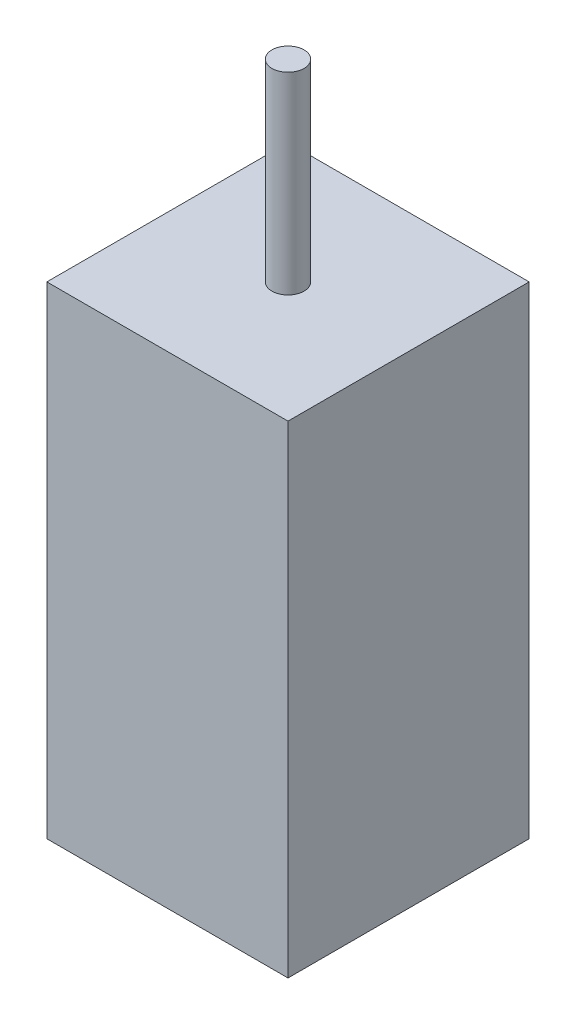
ISO-10303-21;
HEADER;
FILE_DESCRIPTION(('STEP AP214'),'2;1');
FILE_NAME('part.step','',(''),(''),'','','');
FILE_SCHEMA(('AUTOMOTIVE_DESIGN { 1 0 10303 214 1 1 1 1 }'));
ENDSEC;
DATA;
#1=APPLICATION_CONTEXT('core data for automotive mechanical design processes');
#2=APPLICATION_PROTOCOL_DEFINITION('international standard','automotive_design',2000,#1);
#3=PRODUCT_CONTEXT('',#1,'mechanical');
#4=PRODUCT('Part','Part','',(#3));
#5=PRODUCT_RELATED_PRODUCT_CATEGORY('part','',(#4));
#6=PRODUCT_DEFINITION_FORMATION('','',#4);
#7=PRODUCT_DEFINITION_CONTEXT('part definition',#1,'design');
#8=PRODUCT_DEFINITION('design','',#6,#7);
#9=PRODUCT_DEFINITION_SHAPE('','',#8);
#10=(LENGTH_UNIT() NAMED_UNIT(*) SI_UNIT(.MILLI.,.METRE.));
#11=(NAMED_UNIT(*) PLANE_ANGLE_UNIT() SI_UNIT($,.RADIAN.));
#12=(NAMED_UNIT(*) SI_UNIT($,.STERADIAN.) SOLID_ANGLE_UNIT());
#13=UNCERTAINTY_MEASURE_WITH_UNIT(LENGTH_MEASURE(1.E-05),#10,'distance_accuracy_value','');
#14=(GEOMETRIC_REPRESENTATION_CONTEXT(3) GLOBAL_UNCERTAINTY_ASSIGNED_CONTEXT((#13)) GLOBAL_UNIT_ASSIGNED_CONTEXT((#10,
#11,#12)) REPRESENTATION_CONTEXT('',''));
#15=CARTESIAN_POINT('',(0.,0.,0.));
#16=DIRECTION('',(0.,0.,1.));
#17=DIRECTION('',(1.,0.,0.));
#18=AXIS2_PLACEMENT_3D('',#15,#16,#17);
#19=CARTESIAN_POINT('',(7.5,30.,-7.5));
#20=DIRECTION('',(-1.,0.,0.));
#21=DIRECTION('',(0.,0.,1.));
#22=AXIS2_PLACEMENT_3D('',#19,#20,#21);
#23=PLANE('',#22);
#24=DIRECTION('',(0.,0.,-1.));
#25=VECTOR('',#24,1.);
#26=CARTESIAN_POINT('',(7.5,0.,-7.5));
#27=LINE('',#26,#25);
#28=CARTESIAN_POINT('',(7.5,0.,7.5));
#29=VERTEX_POINT('',#28);
#30=CARTESIAN_POINT('',(7.5,0.,-7.5));
#31=VERTEX_POINT('',#30);
#32=EDGE_CURVE('E96',#29,#31,#27,.T.);
#33=ORIENTED_EDGE('',*,*,#32,.T.);
#34=DIRECTION('',(0.,-1.,0.));
#35=VECTOR('',#34,1.);
#36=CARTESIAN_POINT('',(7.5,30.,-7.5));
#37=LINE('',#36,#35);
#38=CARTESIAN_POINT('',(7.5,30.,-7.5));
#39=VERTEX_POINT('',#38);
#40=EDGE_CURVE('E11',#39,#31,#37,.T.);
#41=ORIENTED_EDGE('',*,*,#40,.F.);
#42=DIRECTION('',(0.,0.,-1.));
#43=VECTOR('',#42,1.);
#44=CARTESIAN_POINT('',(7.5,30.,-7.5));
#45=LINE('',#44,#43);
#46=CARTESIAN_POINT('',(7.5,30.,7.5));
#47=VERTEX_POINT('',#46);
#48=EDGE_CURVE('E84',#47,#39,#45,.T.);
#49=ORIENTED_EDGE('',*,*,#48,.F.);
#50=DIRECTION('',(0.,-1.,0.));
#51=VECTOR('',#50,1.);
#52=CARTESIAN_POINT('',(7.5,30.,7.5));
#53=LINE('',#52,#51);
#54=EDGE_CURVE('E92',#47,#29,#53,.T.);
#55=ORIENTED_EDGE('',*,*,#54,.T.);
#56=EDGE_LOOP('',(#33,#41,#49,#55));
#57=FACE_BOUND('',#56,.T.);
#58=ADVANCED_FACE('F33',(#57),#23,.F.);
#59=CARTESIAN_POINT('',(-7.5,30.,-7.5));
#60=DIRECTION('',(0.,0.,1.));
#61=DIRECTION('',(1.,0.,0.));
#62=AXIS2_PLACEMENT_3D('',#59,#60,#61);
#63=PLANE('',#62);
#64=DIRECTION('',(-1.,0.,0.));
#65=VECTOR('',#64,1.);
#66=CARTESIAN_POINT('',(-7.5,0.,-7.5));
#67=LINE('',#66,#65);
#68=CARTESIAN_POINT('',(-7.5,0.,-7.5));
#69=VERTEX_POINT('',#68);
#70=EDGE_CURVE('E88',#31,#69,#67,.T.);
#71=ORIENTED_EDGE('',*,*,#70,.T.);
#72=DIRECTION('',(0.,-1.,0.));
#73=VECTOR('',#72,1.);
#74=CARTESIAN_POINT('',(-7.5,30.,-7.5));
#75=LINE('',#74,#73);
#76=CARTESIAN_POINT('',(-7.5,30.,-7.5));
#77=VERTEX_POINT('',#76);
#78=EDGE_CURVE('E41',#77,#69,#75,.T.);
#79=ORIENTED_EDGE('',*,*,#78,.F.);
#80=DIRECTION('',(-1.,0.,0.));
#81=VECTOR('',#80,1.);
#82=CARTESIAN_POINT('',(-7.5,30.,-7.5));
#83=LINE('',#82,#81);
#84=EDGE_CURVE('E79',#39,#77,#83,.T.);
#85=ORIENTED_EDGE('',*,*,#84,.F.);
#86=ORIENTED_EDGE('',*,*,#40,.T.);
#87=EDGE_LOOP('',(#71,#79,#85,#86));
#88=FACE_BOUND('',#87,.T.);
#89=ADVANCED_FACE('F87',(#88),#63,.F.);
#90=CARTESIAN_POINT('',(-7.5,30.,-7.5));
#91=DIRECTION('',(1.,0.,0.));
#92=DIRECTION('',(0.,0.,-1.));
#93=AXIS2_PLACEMENT_3D('',#90,#91,#92);
#94=PLANE('',#93);
#95=DIRECTION('',(0.,0.,1.));
#96=VECTOR('',#95,1.);
#97=CARTESIAN_POINT('',(-7.5,0.,-7.5));
#98=LINE('',#97,#96);
#99=CARTESIAN_POINT('',(-7.5,0.,7.5));
#100=VERTEX_POINT('',#99);
#101=EDGE_CURVE('E66',#69,#100,#98,.T.);
#102=ORIENTED_EDGE('',*,*,#101,.T.);
#103=DIRECTION('',(0.,-1.,0.));
#104=VECTOR('',#103,1.);
#105=CARTESIAN_POINT('',(-7.5,30.,7.5));
#106=LINE('',#105,#104);
#107=CARTESIAN_POINT('',(-7.5,30.,7.5));
#108=VERTEX_POINT('',#107);
#109=EDGE_CURVE('E89',#108,#100,#106,.T.);
#110=ORIENTED_EDGE('',*,*,#109,.F.);
#111=DIRECTION('',(0.,0.,1.));
#112=VECTOR('',#111,1.);
#113=CARTESIAN_POINT('',(-7.5,30.,-7.5));
#114=LINE('',#113,#112);
#115=EDGE_CURVE('E82',#77,#108,#114,.T.);
#116=ORIENTED_EDGE('',*,*,#115,.F.);
#117=ORIENTED_EDGE('',*,*,#78,.T.);
#118=EDGE_LOOP('',(#102,#110,#116,#117));
#119=FACE_BOUND('',#118,.T.);
#120=ADVANCED_FACE('F90',(#119),#94,.F.);
#121=CARTESIAN_POINT('',(-7.5,30.,7.5));
#122=DIRECTION('',(0.,0.,-1.));
#123=DIRECTION('',(-1.,0.,0.));
#124=AXIS2_PLACEMENT_3D('',#121,#122,#123);
#125=PLANE('',#124);
#126=DIRECTION('',(1.,0.,0.));
#127=VECTOR('',#126,1.);
#128=CARTESIAN_POINT('',(-7.5,0.,7.5));
#129=LINE('',#128,#127);
#130=EDGE_CURVE('E72',#100,#29,#129,.T.);
#131=ORIENTED_EDGE('',*,*,#130,.T.);
#132=ORIENTED_EDGE('',*,*,#54,.F.);
#133=DIRECTION('',(1.,0.,0.));
#134=VECTOR('',#133,1.);
#135=CARTESIAN_POINT('',(-7.5,30.,7.5));
#136=LINE('',#135,#134);
#137=EDGE_CURVE('E49',#108,#47,#136,.T.);
#138=ORIENTED_EDGE('',*,*,#137,.F.);
#139=ORIENTED_EDGE('',*,*,#109,.T.);
#140=EDGE_LOOP('',(#131,#132,#138,#139));
#141=FACE_BOUND('',#140,.T.);
#142=ADVANCED_FACE('F104',(#141),#125,.F.);
#143=CARTESIAN_POINT('',(0.,30.,0.));
#144=DIRECTION('',(0.,1.,0.));
#145=DIRECTION('',(0.,0.,1.));
#146=AXIS2_PLACEMENT_3D('',#143,#144,#145);
#147=PLANE('',#146);
#148=CARTESIAN_POINT('',(0.,30.,0.));
#149=DIRECTION('',(0.,1.,0.));
#150=DIRECTION('',(0.,0.,1.));
#151=AXIS2_PLACEMENT_3D('',#148,#149,#150);
#152=CIRCLE('',#151,1.);
#153=CARTESIAN_POINT('',(0.,30.,1.));
#154=VERTEX_POINT('',#153);
#155=EDGE_CURVE('E110',#154,#154,#152,.T.);
#156=ORIENTED_EDGE('',*,*,#155,.F.);
#157=EDGE_LOOP('',(#156));
#158=FACE_BOUND('',#157,.T.);
#159=ORIENTED_EDGE('',*,*,#48,.T.);
#160=ORIENTED_EDGE('',*,*,#84,.T.);
#161=ORIENTED_EDGE('',*,*,#115,.T.);
#162=ORIENTED_EDGE('',*,*,#137,.T.);
#163=EDGE_LOOP('',(#159,#160,#161,#162));
#164=FACE_BOUND('',#163,.T.);
#165=ADVANCED_FACE('F80',(#158,#164),#147,.T.);
#166=CARTESIAN_POINT('',(0.,0.,0.));
#167=DIRECTION('',(0.,1.,0.));
#168=DIRECTION('',(0.,0.,1.));
#169=AXIS2_PLACEMENT_3D('',#166,#167,#168);
#170=PLANE('',#169);
#171=ORIENTED_EDGE('',*,*,#32,.F.);
#172=ORIENTED_EDGE('',*,*,#130,.F.);
#173=ORIENTED_EDGE('',*,*,#101,.F.);
#174=ORIENTED_EDGE('',*,*,#70,.F.);
#175=EDGE_LOOP('',(#171,#172,#173,#174));
#176=FACE_BOUND('',#175,.T.);
#177=ADVANCED_FACE('F107',(#176),#170,.F.);
#178=CARTESIAN_POINT('',(0.,42.,0.));
#179=DIRECTION('',(0.,-1.,0.));
#180=DIRECTION('',(0.,0.,-1.));
#181=AXIS2_PLACEMENT_3D('',#178,#179,#180);
#182=CYLINDRICAL_SURFACE('',#181,1.);
#183=CARTESIAN_POINT('',(0.,42.,0.));
#184=DIRECTION('',(0.,1.,0.));
#185=DIRECTION('',(0.,0.,1.));
#186=AXIS2_PLACEMENT_3D('',#183,#184,#185);
#187=CIRCLE('',#186,1.);
#188=CARTESIAN_POINT('',(0.,42.,1.));
#189=VERTEX_POINT('',#188);
#190=EDGE_CURVE('E99',#189,#189,#187,.T.);
#191=ORIENTED_EDGE('',*,*,#190,.F.);
#192=EDGE_LOOP('',(#191));
#193=FACE_BOUND('',#192,.T.);
#194=ORIENTED_EDGE('',*,*,#155,.T.);
#195=EDGE_LOOP('',(#194));
#196=FACE_BOUND('',#195,.T.);
#197=ADVANCED_FACE('F118',(#193,#196),#182,.T.);
#198=CARTESIAN_POINT('',(0.,42.,0.));
#199=DIRECTION('',(0.,1.,0.));
#200=DIRECTION('',(0.,0.,1.));
#201=AXIS2_PLACEMENT_3D('',#198,#199,#200);
#202=PLANE('',#201);
#203=ORIENTED_EDGE('',*,*,#190,.T.);
#204=EDGE_LOOP('',(#203));
#205=FACE_BOUND('',#204,.T.);
#206=ADVANCED_FACE('F116',(#205),#202,.T.);
#207=CLOSED_SHELL('',(#58,#89,#120,#142,#165,#177,#197,#206));
#208=MANIFOLD_SOLID_BREP('B2',#207);
#209=ADVANCED_BREP_SHAPE_REPRESENTATION('',(#18,#208),#14);
#210=SHAPE_DEFINITION_REPRESENTATION(#9,#209);
ENDSEC;
END-ISO-10303-21;
